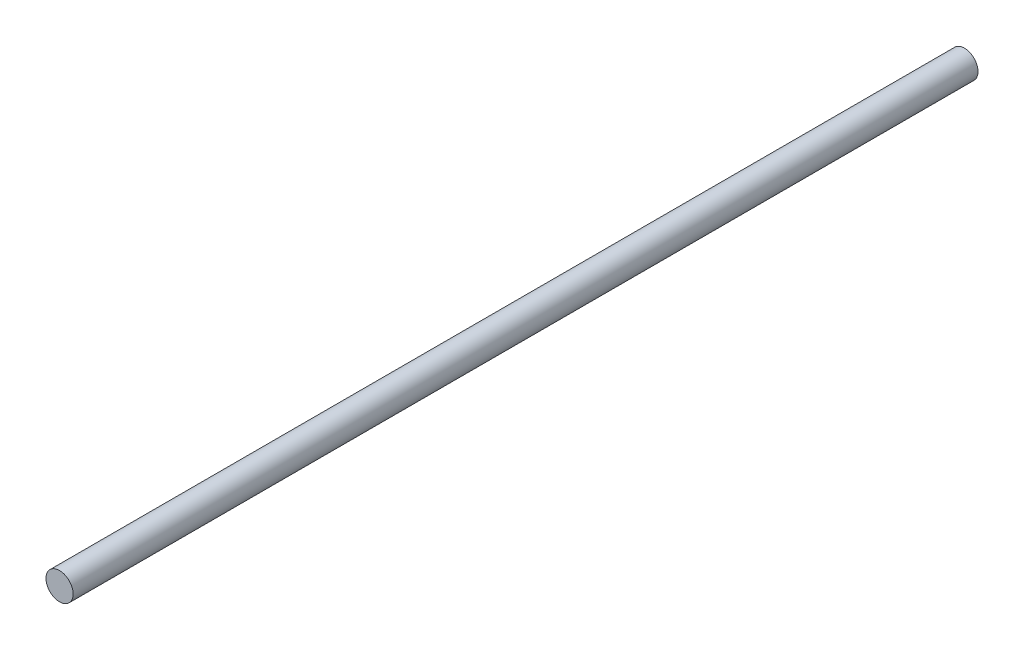
ISO-10303-21;
HEADER;
FILE_DESCRIPTION(('STEP AP214'),'2;1');
FILE_NAME('part.step','',(''),(''),'','','');
FILE_SCHEMA(('AUTOMOTIVE_DESIGN { 1 0 10303 214 1 1 1 1 }'));
ENDSEC;
DATA;
#1=APPLICATION_CONTEXT('core data for automotive mechanical design processes');
#2=APPLICATION_PROTOCOL_DEFINITION('international standard','automotive_design',2000,#1);
#3=PRODUCT_CONTEXT('',#1,'mechanical');
#4=PRODUCT('Part','Part','',(#3));
#5=PRODUCT_RELATED_PRODUCT_CATEGORY('part','',(#4));
#6=PRODUCT_DEFINITION_FORMATION('','',#4);
#7=PRODUCT_DEFINITION_CONTEXT('part definition',#1,'design');
#8=PRODUCT_DEFINITION('design','',#6,#7);
#9=PRODUCT_DEFINITION_SHAPE('','',#8);
#10=(LENGTH_UNIT() NAMED_UNIT(*) SI_UNIT(.MILLI.,.METRE.));
#11=(NAMED_UNIT(*) PLANE_ANGLE_UNIT() SI_UNIT($,.RADIAN.));
#12=(NAMED_UNIT(*) SI_UNIT($,.STERADIAN.) SOLID_ANGLE_UNIT());
#13=UNCERTAINTY_MEASURE_WITH_UNIT(LENGTH_MEASURE(1.E-05),#10,'distance_accuracy_value','');
#14=(GEOMETRIC_REPRESENTATION_CONTEXT(3) GLOBAL_UNCERTAINTY_ASSIGNED_CONTEXT((#13)) GLOBAL_UNIT_ASSIGNED_CONTEXT((#10,
#11,#12)) REPRESENTATION_CONTEXT('',''));
#15=CARTESIAN_POINT('',(0.,0.,0.));
#16=DIRECTION('',(0.,0.,1.));
#17=DIRECTION('',(1.,0.,0.));
#18=AXIS2_PLACEMENT_3D('',#15,#16,#17);
#19=CARTESIAN_POINT('',(0.,0.,100.));
#20=DIRECTION('',(0.,0.,-1.));
#21=DIRECTION('',(-1.,0.,0.));
#22=AXIS2_PLACEMENT_3D('',#19,#20,#21);
#23=CYLINDRICAL_SURFACE('',#22,3.);
#24=CARTESIAN_POINT('',(0.,0.,100.));
#25=DIRECTION('',(0.,0.,1.));
#26=DIRECTION('',(1.,0.,0.));
#27=AXIS2_PLACEMENT_3D('',#24,#25,#26);
#28=CIRCLE('',#27,3.);
#29=CARTESIAN_POINT('',(3.,0.,100.));
#30=VERTEX_POINT('',#29);
#31=EDGE_CURVE('E10',#30,#30,#28,.T.);
#32=ORIENTED_EDGE('',*,*,#31,.F.);
#33=EDGE_LOOP('',(#32));
#34=FACE_BOUND('',#33,.T.);
#35=CARTESIAN_POINT('',(0.,0.,-100.));
#36=DIRECTION('',(0.,0.,1.));
#37=DIRECTION('',(1.,0.,0.));
#38=AXIS2_PLACEMENT_3D('',#35,#36,#37);
#39=CIRCLE('',#38,3.);
#40=CARTESIAN_POINT('',(3.,0.,-100.));
#41=VERTEX_POINT('',#40);
#42=EDGE_CURVE('E40',#41,#41,#39,.T.);
#43=ORIENTED_EDGE('',*,*,#42,.T.);
#44=EDGE_LOOP('',(#43));
#45=FACE_BOUND('',#44,.T.);
#46=ADVANCED_FACE('F37',(#34,#45),#23,.T.);
#47=CARTESIAN_POINT('',(0.,0.,100.));
#48=DIRECTION('',(0.,0.,1.));
#49=DIRECTION('',(1.,0.,0.));
#50=AXIS2_PLACEMENT_3D('',#47,#48,#49);
#51=PLANE('',#50);
#52=ORIENTED_EDGE('',*,*,#31,.T.);
#53=EDGE_LOOP('',(#52));
#54=FACE_BOUND('',#53,.T.);
#55=ADVANCED_FACE('F54',(#54),#51,.T.);
#56=CARTESIAN_POINT('',(0.,0.,-100.));
#57=DIRECTION('',(0.,0.,1.));
#58=DIRECTION('',(1.,0.,0.));
#59=AXIS2_PLACEMENT_3D('',#56,#57,#58);
#60=PLANE('',#59);
#61=ORIENTED_EDGE('',*,*,#42,.F.);
#62=EDGE_LOOP('',(#61));
#63=FACE_BOUND('',#62,.T.);
#64=ADVANCED_FACE('F52',(#63),#60,.F.);
#65=CLOSED_SHELL('',(#46,#55,#64));
#66=MANIFOLD_SOLID_BREP('B2',#65);
#67=ADVANCED_BREP_SHAPE_REPRESENTATION('',(#18,#66),#14);
#68=SHAPE_DEFINITION_REPRESENTATION(#9,#67);
ENDSEC;
END-ISO-10303-21;
